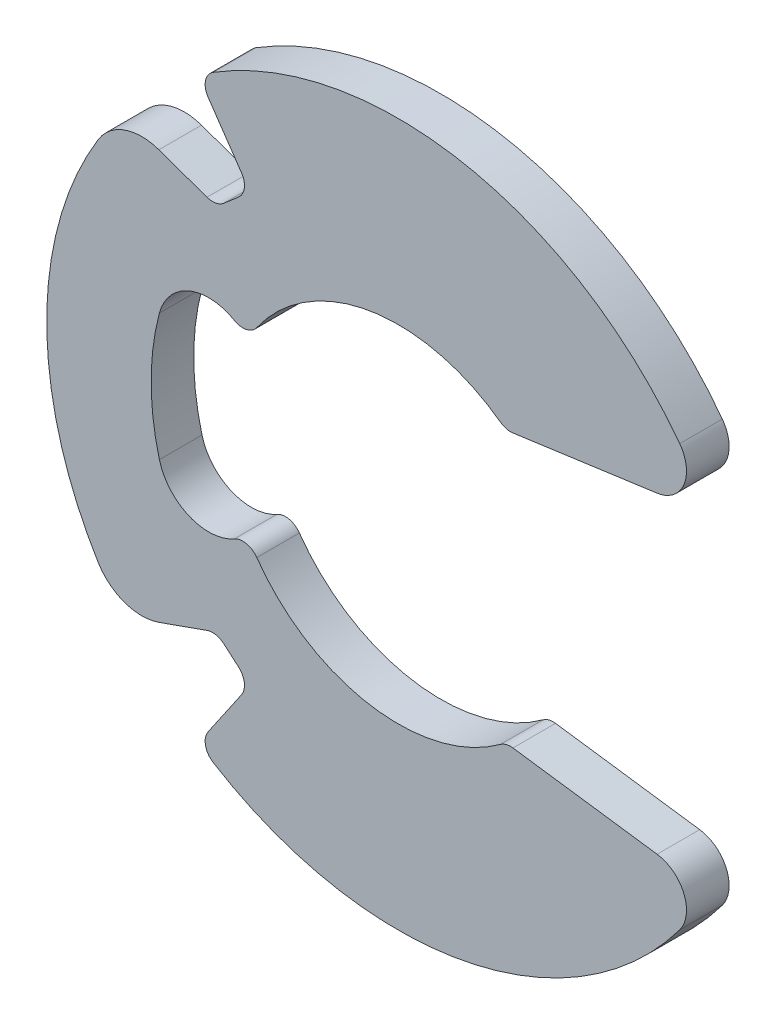
ISO-10303-21;
HEADER;
FILE_DESCRIPTION(('STEP AP214'),'2;1');
FILE_NAME('part.step','',(''),(''),'','','');
FILE_SCHEMA(('AUTOMOTIVE_DESIGN { 1 0 10303 214 1 1 1 1 }'));
ENDSEC;
DATA;
#1=APPLICATION_CONTEXT('core data for automotive mechanical design processes');
#2=APPLICATION_PROTOCOL_DEFINITION('international standard','automotive_design',2000,#1);
#3=PRODUCT_CONTEXT('',#1,'mechanical');
#4=PRODUCT('Part','Part','',(#3));
#5=PRODUCT_RELATED_PRODUCT_CATEGORY('part','',(#4));
#6=PRODUCT_DEFINITION_FORMATION('','',#4);
#7=PRODUCT_DEFINITION_CONTEXT('part definition',#1,'design');
#8=PRODUCT_DEFINITION('design','',#6,#7);
#9=PRODUCT_DEFINITION_SHAPE('','',#8);
#10=(LENGTH_UNIT() NAMED_UNIT(*) SI_UNIT(.MILLI.,.METRE.));
#11=(NAMED_UNIT(*) PLANE_ANGLE_UNIT() SI_UNIT($,.RADIAN.));
#12=(NAMED_UNIT(*) SI_UNIT($,.STERADIAN.) SOLID_ANGLE_UNIT());
#13=UNCERTAINTY_MEASURE_WITH_UNIT(LENGTH_MEASURE(1.E-05),#10,'distance_accuracy_value','');
#14=(GEOMETRIC_REPRESENTATION_CONTEXT(3) GLOBAL_UNCERTAINTY_ASSIGNED_CONTEXT((#13)) GLOBAL_UNIT_ASSIGNED_CONTEXT((#10,
#11,#12)) REPRESENTATION_CONTEXT('',''));
#15=CARTESIAN_POINT('',(0.,0.,0.));
#16=DIRECTION('',(0.,0.,1.));
#17=DIRECTION('',(1.,0.,0.));
#18=AXIS2_PLACEMENT_3D('',#15,#16,#17);
#19=CARTESIAN_POINT('',(0.,0.,1.27));
#20=DIRECTION('',(0.,0.,-1.));
#21=DIRECTION('',(-1.,0.,0.));
#22=AXIS2_PLACEMENT_3D('',#19,#20,#21);
#23=PLANE('',#22);
#24=CARTESIAN_POINT('',(0.,0.,1.27));
#25=DIRECTION('',(0.,0.,-1.));
#26=DIRECTION('',(1.,0.,0.));
#27=AXIS2_PLACEMENT_3D('',#24,#25,#26);
#28=CIRCLE('',#27,10.4775);
#29=CARTESIAN_POINT('',(8.39050144990017,-6.27514873682076,1.27));
#30=VERTEX_POINT('',#29);
#31=CARTESIAN_POINT('',(-5.51465485817055,-8.90879273780998,1.27));
#32=VERTEX_POINT('',#31);
#33=EDGE_CURVE('E432',#30,#32,#28,.T.);
#34=ORIENTED_EDGE('',*,*,#33,.F.);
#35=CARTESIAN_POINT('',(7.57687706687955,-5.66664946537147,1.27));
#36=DIRECTION('',(0.,0.,-1.));
#37=DIRECTION('',(-1.,0.,0.));
#38=AXIS2_PLACEMENT_3D('',#35,#36,#37);
#39=CIRCLE('',#38,1.016);
#40=CARTESIAN_POINT('',(7.71621548730132,-4.66024954258016,1.27));
#41=VERTEX_POINT('',#40);
#42=EDGE_CURVE('E10',#30,#41,#39,.F.);
#43=ORIENTED_EDGE('',*,*,#42,.T.);
#44=DIRECTION('',(0.990551105109562,-0.137144114588364,0.));
#45=VECTOR('',#44,1.);
#46=CARTESIAN_POINT('',(0.,-3.59192148204873,1.27));
#47=LINE('',#46,#45);
#48=CARTESIAN_POINT('',(3.41825205926127,-4.06518646523744,1.27));
#49=VERTEX_POINT('',#48);
#50=EDGE_CURVE('E396',#49,#41,#47,.T.);
#51=ORIENTED_EDGE('',*,*,#50,.F.);
#52=CARTESIAN_POINT('',(3.34858284905039,-4.5683864266331,1.27));
#53=DIRECTION('',(0.,0.,-1.));
#54=DIRECTION('',(-1.,0.,0.));
#55=AXIS2_PLACEMENT_3D('',#52,#53,#54);
#56=CIRCLE('',#55,0.508);
#57=CARTESIAN_POINT('',(3.04826151729699,-4.15866567088125,1.27));
#58=VERTEX_POINT('',#57);
#59=EDGE_CURVE('E359',#49,#58,#56,.F.);
#60=ORIENTED_EDGE('',*,*,#59,.T.);
#61=CARTESIAN_POINT('',(0.,0.,1.27));
#62=DIRECTION('',(0.,0.,-1.));
#63=DIRECTION('',(1.,0.,0.));
#64=AXIS2_PLACEMENT_3D('',#61,#62,#63);
#65=CIRCLE('',#64,5.1562);
#66=CARTESIAN_POINT('',(-4.21618561440545,-2.96819428354689,1.27));
#67=VERTEX_POINT('',#66);
#68=EDGE_CURVE('E436',#58,#67,#65,.T.);
#69=ORIENTED_EDGE('',*,*,#68,.T.);
#70=CARTESIAN_POINT('',(-4.63157335966707,-3.26062721788649,1.27));
#71=DIRECTION('',(0.,0.,-1.));
#72=DIRECTION('',(-1.,0.,0.));
#73=AXIS2_PLACEMENT_3D('',#70,#71,#72);
#74=CIRCLE('',#73,0.508);
#75=CARTESIAN_POINT('',(-4.88521418696267,-2.82047913970278,1.27));
#76=VERTEX_POINT('',#75);
#77=EDGE_CURVE('E368',#67,#76,#74,.F.);
#78=ORIENTED_EDGE('',*,*,#77,.T.);
#79=CARTESIAN_POINT('',(-5.64613666884946,-1.50003490515168,1.27));
#80=DIRECTION('',(0.,0.,-1.));
#81=DIRECTION('',(-1.,0.,0.));
#82=AXIS2_PLACEMENT_3D('',#79,#80,#81);
#83=CIRCLE('',#82,1.524);
#84=CARTESIAN_POINT('',(-7.11904188681019,-1.89134835866951,1.27));
#85=VERTEX_POINT('',#84);
#86=EDGE_CURVE('E261',#76,#85,#83,.T.);
#87=ORIENTED_EDGE('',*,*,#86,.T.);
#88=CARTESIAN_POINT('',(0.,0.,1.27));
#89=DIRECTION('',(0.,0.,-1.));
#90=DIRECTION('',(0.,1.,0.));
#91=AXIS2_PLACEMENT_3D('',#88,#89,#90);
#92=CIRCLE('',#91,7.366);
#93=CARTESIAN_POINT('',(-7.1190418868102,1.89134835866951,1.27));
#94=VERTEX_POINT('',#93);
#95=EDGE_CURVE('E468',#85,#94,#92,.T.);
#96=ORIENTED_EDGE('',*,*,#95,.T.);
#97=CARTESIAN_POINT('',(-5.64613666884946,1.50003490515168,1.27));
#98=DIRECTION('',(0.,0.,-1.));
#99=DIRECTION('',(-1.,0.,0.));
#100=AXIS2_PLACEMENT_3D('',#97,#98,#99);
#101=CIRCLE('',#100,1.524);
#102=CARTESIAN_POINT('',(-4.88521418696268,2.82047913970278,1.27));
#103=VERTEX_POINT('',#102);
#104=EDGE_CURVE('E269',#94,#103,#101,.T.);
#105=ORIENTED_EDGE('',*,*,#104,.T.);
#106=CARTESIAN_POINT('',(-4.63157335966708,3.26062721788649,1.27));
#107=DIRECTION('',(0.,0.,-1.));
#108=DIRECTION('',(-1.,0.,0.));
#109=AXIS2_PLACEMENT_3D('',#106,#107,#108);
#110=CIRCLE('',#109,0.508);
#111=CARTESIAN_POINT('',(-4.21618561440546,2.96819428354689,1.27));
#112=VERTEX_POINT('',#111);
#113=EDGE_CURVE('E373',#103,#112,#110,.F.);
#114=ORIENTED_EDGE('',*,*,#113,.T.);
#115=CARTESIAN_POINT('',(3.048261517297,4.15866567088126,1.27));
#116=VERTEX_POINT('',#115);
#117=EDGE_CURVE('E434',#112,#116,#65,.T.);
#118=ORIENTED_EDGE('',*,*,#117,.T.);
#119=CARTESIAN_POINT('',(3.3485828490504,4.5683864266331,1.27));
#120=DIRECTION('',(0.,0.,-1.));
#121=DIRECTION('',(-1.,0.,0.));
#122=AXIS2_PLACEMENT_3D('',#119,#120,#121);
#123=CIRCLE('',#122,0.508);
#124=CARTESIAN_POINT('',(3.41825205926129,4.06518646523744,1.27));
#125=VERTEX_POINT('',#124);
#126=EDGE_CURVE('E287',#116,#125,#123,.F.);
#127=ORIENTED_EDGE('',*,*,#126,.T.);
#128=DIRECTION('',(-0.990551105109562,-0.137144114588364,0.));
#129=VECTOR('',#128,1.);
#130=CARTESIAN_POINT('',(11.2983179723503,5.15619999999999,1.27));
#131=LINE('',#130,#129);
#132=CARTESIAN_POINT('',(7.71621548730134,4.66024954258016,1.27));
#133=VERTEX_POINT('',#132);
#134=EDGE_CURVE('E411',#133,#125,#131,.T.);
#135=ORIENTED_EDGE('',*,*,#134,.F.);
#136=CARTESIAN_POINT('',(7.57687706687956,5.66664946537147,1.27));
#137=DIRECTION('',(0.,0.,-1.));
#138=DIRECTION('',(-1.,0.,0.));
#139=AXIS2_PLACEMENT_3D('',#136,#137,#138);
#140=CIRCLE('',#139,1.016);
#141=CARTESIAN_POINT('',(8.39050144990018,6.27514873682076,1.27));
#142=VERTEX_POINT('',#141);
#143=EDGE_CURVE('E382',#133,#142,#140,.F.);
#144=ORIENTED_EDGE('',*,*,#143,.T.);
#145=CARTESIAN_POINT('',(-5.51465485817056,8.90879273780999,1.27));
#146=VERTEX_POINT('',#145);
#147=EDGE_CURVE('E431',#146,#142,#28,.T.);
#148=ORIENTED_EDGE('',*,*,#147,.F.);
#149=CARTESIAN_POINT('',(-5.24727765292592,8.47685127173435,1.27));
#150=DIRECTION('',(0.,0.,-1.));
#151=DIRECTION('',(-1.,0.,0.));
#152=AXIS2_PLACEMENT_3D('',#149,#150,#151);
#153=CIRCLE('',#152,0.508);
#154=CARTESIAN_POINT('',(-5.6664647231543,8.18989099547063,1.27));
#155=VERTEX_POINT('',#154);
#156=EDGE_CURVE('E345',#146,#155,#153,.F.);
#157=ORIENTED_EDGE('',*,*,#156,.T.);
#158=DIRECTION('',(0.564882433590001,-0.825171398087354,0.));
#159=VECTOR('',#158,1.);
#160=CARTESIAN_POINT('',(-7.96096866359448,11.541666359447,1.27));
#161=LINE('',#160,#159);
#162=CARTESIAN_POINT('',(-4.67174469224146,6.73681957776462,1.27));
#163=VERTEX_POINT('',#162);
#164=EDGE_CURVE('E465',#155,#163,#161,.T.);
#165=ORIENTED_EDGE('',*,*,#164,.T.);
#166=CARTESIAN_POINT('',(-5.09093176246983,6.4498593015009,1.27));
#167=DIRECTION('',(0.,0.,-1.));
#168=DIRECTION('',(-1.,0.,0.));
#169=AXIS2_PLACEMENT_3D('',#166,#167,#168);
#170=CIRCLE('',#169,0.508);
#171=CARTESIAN_POINT('',(-4.75923843445855,6.0650950410078,1.27));
#172=VERTEX_POINT('',#171);
#173=EDGE_CURVE('E317',#163,#172,#170,.T.);
#174=ORIENTED_EDGE('',*,*,#173,.T.);
#175=DIRECTION('',(-0.757409961600578,-0.652939622069462,0.));
#176=VECTOR('',#175,1.);
#177=CARTESIAN_POINT('',(-4.41503502304148,6.36182211981562,1.27));
#178=LINE('',#177,#176);
#179=CARTESIAN_POINT('',(-5.19974545035898,5.68534761350743,1.27));
#180=VERTEX_POINT('',#179);
#181=EDGE_CURVE('E460',#172,#180,#178,.T.);
#182=ORIENTED_EDGE('',*,*,#181,.T.);
#183=CARTESIAN_POINT('',(-5.53143877837027,6.07011187400052,1.27));
#184=DIRECTION('',(0.,0.,-1.));
#185=DIRECTION('',(-1.,0.,0.));
#186=AXIS2_PLACEMENT_3D('',#183,#184,#185);
#187=CIRCLE('',#186,0.508);
#188=CARTESIAN_POINT('',(-5.70123922502142,5.59133028672186,1.27));
#189=VERTEX_POINT('',#188);
#190=EDGE_CURVE('E308',#180,#189,#187,.T.);
#191=ORIENTED_EDGE('',*,*,#190,.T.);
#192=DIRECTION('',(-0.942483439524914,0.334252847738487,0.));
#193=VECTOR('',#192,1.);
#194=CARTESIAN_POINT('',(-5.42319262672811,5.49272073732714,1.27));
#195=LINE('',#194,#193);
#196=CARTESIAN_POINT('',(-7.13394241485243,6.09944013892937,1.27));
#197=VERTEX_POINT('',#196);
#198=EDGE_CURVE('E454',#189,#197,#195,.T.);
#199=ORIENTED_EDGE('',*,*,#198,.T.);
#200=CARTESIAN_POINT('',(-7.64334375480589,4.6630953770934,1.27));
#201=DIRECTION('',(0.,0.,-1.));
#202=DIRECTION('',(-1.,0.,0.));
#203=AXIS2_PLACEMENT_3D('',#200,#201,#202);
#204=CIRCLE('',#203,1.524);
#205=CARTESIAN_POINT('',(-8.94433843647498,5.45681373915185,1.27));
#206=VERTEX_POINT('',#205);
#207=EDGE_CURVE('E282',#197,#206,#204,.F.);
#208=ORIENTED_EDGE('',*,*,#207,.T.);
#209=CARTESIAN_POINT('',(-8.94433843647497,-5.45681373915185,1.27));
#210=VERTEX_POINT('',#209);
#211=EDGE_CURVE('E435',#210,#206,#28,.T.);
#212=ORIENTED_EDGE('',*,*,#211,.F.);
#213=CARTESIAN_POINT('',(-7.64334375480588,-4.6630953770934,1.27));
#214=DIRECTION('',(0.,0.,-1.));
#215=DIRECTION('',(-1.,0.,0.));
#216=AXIS2_PLACEMENT_3D('',#213,#214,#215);
#217=CIRCLE('',#216,1.524);
#218=CARTESIAN_POINT('',(-7.13394241485243,-6.09944013892937,1.27));
#219=VERTEX_POINT('',#218);
#220=EDGE_CURVE('E256',#210,#219,#217,.F.);
#221=ORIENTED_EDGE('',*,*,#220,.T.);
#222=DIRECTION('',(-0.942483439524914,-0.334252847738487,0.));
#223=VECTOR('',#222,1.);
#224=CARTESIAN_POINT('',(-5.42319262672811,-5.49272073732714,1.27));
#225=LINE('',#224,#223);
#226=CARTESIAN_POINT('',(-5.70123922502142,-5.59133028672186,1.27));
#227=VERTEX_POINT('',#226);
#228=EDGE_CURVE('E227',#227,#219,#225,.T.);
#229=ORIENTED_EDGE('',*,*,#228,.F.);
#230=CARTESIAN_POINT('',(-5.53143877837027,-6.07011187400052,1.27));
#231=DIRECTION('',(0.,0.,-1.));
#232=DIRECTION('',(-1.,0.,0.));
#233=AXIS2_PLACEMENT_3D('',#230,#231,#232);
#234=CIRCLE('',#233,0.508);
#235=CARTESIAN_POINT('',(-5.19974545035898,-5.68534761350743,1.27));
#236=VERTEX_POINT('',#235);
#237=EDGE_CURVE('E299',#227,#236,#234,.T.);
#238=ORIENTED_EDGE('',*,*,#237,.T.);
#239=DIRECTION('',(-0.757409961600578,0.652939622069462,0.));
#240=VECTOR('',#239,1.);
#241=CARTESIAN_POINT('',(-4.41503502304148,-6.36182211981562,1.27));
#242=LINE('',#241,#240);
#243=CARTESIAN_POINT('',(-4.75923843445855,-6.0650950410078,1.27));
#244=VERTEX_POINT('',#243);
#245=EDGE_CURVE('E421',#244,#236,#242,.T.);
#246=ORIENTED_EDGE('',*,*,#245,.F.);
#247=CARTESIAN_POINT('',(-5.09093176246983,-6.4498593015009,1.27));
#248=DIRECTION('',(0.,0.,-1.));
#249=DIRECTION('',(-1.,0.,0.));
#250=AXIS2_PLACEMENT_3D('',#247,#248,#249);
#251=CIRCLE('',#250,0.508);
#252=CARTESIAN_POINT('',(-4.67174469224146,-6.73681957776462,1.27));
#253=VERTEX_POINT('',#252);
#254=EDGE_CURVE('E326',#244,#253,#251,.T.);
#255=ORIENTED_EDGE('',*,*,#254,.T.);
#256=DIRECTION('',(0.564882433590001,0.825171398087354,0.));
#257=VECTOR('',#256,1.);
#258=CARTESIAN_POINT('',(-7.96096866359448,-11.541666359447,1.27));
#259=LINE('',#258,#257);
#260=CARTESIAN_POINT('',(-5.66646472315429,-8.18989099547062,1.27));
#261=VERTEX_POINT('',#260);
#262=EDGE_CURVE('E451',#261,#253,#259,.T.);
#263=ORIENTED_EDGE('',*,*,#262,.F.);
#264=CARTESIAN_POINT('',(-5.24727765292592,-8.47685127173434,1.27));
#265=DIRECTION('',(0.,0.,-1.));
#266=DIRECTION('',(-1.,0.,0.));
#267=AXIS2_PLACEMENT_3D('',#264,#265,#266);
#268=CIRCLE('',#267,0.508);
#269=EDGE_CURVE('E334',#261,#32,#268,.F.);
#270=ORIENTED_EDGE('',*,*,#269,.T.);
#271=EDGE_LOOP('',(#34,#43,#51,#60,#69,#78,#87,#96,#105,#114,#118,#127,#135,#144,#148,#157,#165,
#174,#182,#191,#199,#208,#212,#221,#229,#238,#246,#255,#263,#270));
#272=FACE_BOUND('',#271,.T.);
#273=ADVANCED_FACE('F15',(#272),#23,.F.);
#274=CARTESIAN_POINT('',(0.,0.,0.));
#275=DIRECTION('',(0.,0.,-1.));
#276=DIRECTION('',(-1.,0.,0.));
#277=AXIS2_PLACEMENT_3D('',#274,#275,#276);
#278=PLANE('',#277);
#279=DIRECTION('',(-0.990551105109562,0.137144114588364,0.));
#280=VECTOR('',#279,1.);
#281=CARTESIAN_POINT('',(-0.487956262792466,-3.52436279752117,0.));
#282=LINE('',#281,#280);
#283=CARTESIAN_POINT('',(7.71621548730133,-4.66024954258016,0.));
#284=VERTEX_POINT('',#283);
#285=CARTESIAN_POINT('',(3.41825205926127,-4.06518646523744,0.));
#286=VERTEX_POINT('',#285);
#287=EDGE_CURVE('E236',#284,#286,#282,.T.);
#288=ORIENTED_EDGE('',*,*,#287,.F.);
#289=CARTESIAN_POINT('',(7.57687706687955,-5.66664946537147,0.));
#290=DIRECTION('',(0.,0.,-1.));
#291=DIRECTION('',(-1.,0.,0.));
#292=AXIS2_PLACEMENT_3D('',#289,#290,#291);
#293=CIRCLE('',#292,1.016);
#294=CARTESIAN_POINT('',(8.39050144990017,-6.27514873682076,0.));
#295=VERTEX_POINT('',#294);
#296=EDGE_CURVE('E37',#284,#295,#293,.T.);
#297=ORIENTED_EDGE('',*,*,#296,.T.);
#298=CARTESIAN_POINT('',(0.,0.,0.));
#299=DIRECTION('',(0.,0.,-1.));
#300=DIRECTION('',(1.,0.,0.));
#301=AXIS2_PLACEMENT_3D('',#298,#299,#300);
#302=CIRCLE('',#301,10.4775);
#303=CARTESIAN_POINT('',(-5.51465485817055,-8.90879273780998,0.));
#304=VERTEX_POINT('',#303);
#305=EDGE_CURVE('E425',#295,#304,#302,.T.);
#306=ORIENTED_EDGE('',*,*,#305,.T.);
#307=CARTESIAN_POINT('',(-5.24727765292592,-8.47685127173434,0.));
#308=DIRECTION('',(0.,0.,-1.));
#309=DIRECTION('',(-1.,0.,0.));
#310=AXIS2_PLACEMENT_3D('',#307,#308,#309);
#311=CIRCLE('',#310,0.508);
#312=CARTESIAN_POINT('',(-5.6664647231543,-8.18989099547062,0.));
#313=VERTEX_POINT('',#312);
#314=EDGE_CURVE('E340',#304,#313,#311,.T.);
#315=ORIENTED_EDGE('',*,*,#314,.T.);
#316=DIRECTION('',(-0.56488243359,-0.825171398087354,0.));
#317=VECTOR('',#316,1.);
#318=CARTESIAN_POINT('',(-0.0408287063206822,0.0279498526490687,0.));
#319=LINE('',#318,#317);
#320=CARTESIAN_POINT('',(-4.67174469224146,-6.73681957776462,0.));
#321=VERTEX_POINT('',#320);
#322=EDGE_CURVE('E239',#321,#313,#319,.T.);
#323=ORIENTED_EDGE('',*,*,#322,.F.);
#324=CARTESIAN_POINT('',(-5.09093176246983,-6.4498593015009,0.));
#325=DIRECTION('',(0.,0.,-1.));
#326=DIRECTION('',(-1.,0.,0.));
#327=AXIS2_PLACEMENT_3D('',#324,#325,#326);
#328=CIRCLE('',#327,0.508);
#329=CARTESIAN_POINT('',(-4.75923843445854,-6.0650950410078,0.));
#330=VERTEX_POINT('',#329);
#331=EDGE_CURVE('E329',#321,#330,#328,.F.);
#332=ORIENTED_EDGE('',*,*,#331,.T.);
#333=DIRECTION('',(0.757409961600578,-0.652939622069462,0.));
#334=VECTOR('',#333,1.);
#335=CARTESIAN_POINT('',(-5.02845697562567,-5.8330100917258,0.));
#336=LINE('',#335,#334);
#337=CARTESIAN_POINT('',(-5.19974545035898,-5.68534761350743,0.));
#338=VERTEX_POINT('',#337);
#339=EDGE_CURVE('E235',#338,#330,#336,.T.);
#340=ORIENTED_EDGE('',*,*,#339,.F.);
#341=CARTESIAN_POINT('',(-5.53143877837027,-6.07011187400052,0.));
#342=DIRECTION('',(0.,0.,-1.));
#343=DIRECTION('',(-1.,0.,0.));
#344=AXIS2_PLACEMENT_3D('',#341,#342,#343);
#345=CIRCLE('',#344,0.508);
#346=CARTESIAN_POINT('',(-5.70123922502142,-5.59133028672186,0.));
#347=VERTEX_POINT('',#346);
#348=EDGE_CURVE('E234',#338,#347,#345,.F.);
#349=ORIENTED_EDGE('',*,*,#348,.T.);
#350=DIRECTION('',(0.942483439524914,0.334252847738487,0.));
#351=VECTOR('',#350,1.);
#352=CARTESIAN_POINT('',(1.12445357189555,-3.17059039944317,0.));
#353=LINE('',#352,#351);
#354=CARTESIAN_POINT('',(-7.13394241485243,-6.09944013892937,0.));
#355=VERTEX_POINT('',#354);
#356=EDGE_CURVE('E224',#355,#347,#353,.T.);
#357=ORIENTED_EDGE('',*,*,#356,.F.);
#358=CARTESIAN_POINT('',(-7.64334375480588,-4.6630953770934,0.));
#359=DIRECTION('',(0.,0.,-1.));
#360=DIRECTION('',(-1.,0.,0.));
#361=AXIS2_PLACEMENT_3D('',#358,#359,#360);
#362=CIRCLE('',#361,1.524);
#363=CARTESIAN_POINT('',(-8.94433843647497,-5.45681373915185,0.));
#364=VERTEX_POINT('',#363);
#365=EDGE_CURVE('E210',#355,#364,#362,.T.);
#366=ORIENTED_EDGE('',*,*,#365,.T.);
#367=CARTESIAN_POINT('',(-8.94433843647498,5.45681373915185,0.));
#368=VERTEX_POINT('',#367);
#369=EDGE_CURVE('E429',#364,#368,#302,.T.);
#370=ORIENTED_EDGE('',*,*,#369,.T.);
#371=CARTESIAN_POINT('',(-7.64334375480589,4.6630953770934,0.));
#372=DIRECTION('',(0.,0.,-1.));
#373=DIRECTION('',(-1.,0.,0.));
#374=AXIS2_PLACEMENT_3D('',#371,#372,#373);
#375=CIRCLE('',#374,1.524);
#376=CARTESIAN_POINT('',(-7.13394241485243,6.09944013892937,0.));
#377=VERTEX_POINT('',#376);
#378=EDGE_CURVE('E277',#368,#377,#375,.T.);
#379=ORIENTED_EDGE('',*,*,#378,.T.);
#380=DIRECTION('',(0.942483439524914,-0.334252847738487,0.));
#381=VECTOR('',#380,1.);
#382=CARTESIAN_POINT('',(1.12445357189554,3.17059039944317,0.));
#383=LINE('',#382,#381);
#384=CARTESIAN_POINT('',(-5.70123922502143,5.59133028672186,0.));
#385=VERTEX_POINT('',#384);
#386=EDGE_CURVE('E251',#377,#385,#383,.T.);
#387=ORIENTED_EDGE('',*,*,#386,.T.);
#388=CARTESIAN_POINT('',(-5.53143877837027,6.07011187400052,0.));
#389=DIRECTION('',(0.,0.,-1.));
#390=DIRECTION('',(-1.,0.,0.));
#391=AXIS2_PLACEMENT_3D('',#388,#389,#390);
#392=CIRCLE('',#391,0.508);
#393=CARTESIAN_POINT('',(-5.19974545035898,5.68534761350743,0.));
#394=VERTEX_POINT('',#393);
#395=EDGE_CURVE('E310',#385,#394,#392,.F.);
#396=ORIENTED_EDGE('',*,*,#395,.T.);
#397=DIRECTION('',(0.757409961600578,0.652939622069462,0.));
#398=VECTOR('',#397,1.);
#399=CARTESIAN_POINT('',(-5.02845697562567,5.8330100917258,0.));
#400=LINE('',#399,#398);
#401=CARTESIAN_POINT('',(-4.75923843445855,6.0650950410078,0.));
#402=VERTEX_POINT('',#401);
#403=EDGE_CURVE('E248',#394,#402,#400,.T.);
#404=ORIENTED_EDGE('',*,*,#403,.T.);
#405=CARTESIAN_POINT('',(-5.09093176246983,6.4498593015009,0.));
#406=DIRECTION('',(0.,0.,-1.));
#407=DIRECTION('',(-1.,0.,0.));
#408=AXIS2_PLACEMENT_3D('',#405,#406,#407);
#409=CIRCLE('',#408,0.508);
#410=CARTESIAN_POINT('',(-4.67174469224146,6.73681957776462,0.));
#411=VERTEX_POINT('',#410);
#412=EDGE_CURVE('E319',#402,#411,#409,.F.);
#413=ORIENTED_EDGE('',*,*,#412,.T.);
#414=DIRECTION('',(-0.564882433590001,0.825171398087354,0.));
#415=VECTOR('',#414,1.);
#416=CARTESIAN_POINT('',(-0.0408287063206891,-0.0279498526490583,0.));
#417=LINE('',#416,#415);
#418=CARTESIAN_POINT('',(-5.6664647231543,8.18989099547063,0.));
#419=VERTEX_POINT('',#418);
#420=EDGE_CURVE('E245',#411,#419,#417,.T.);
#421=ORIENTED_EDGE('',*,*,#420,.T.);
#422=CARTESIAN_POINT('',(-5.24727765292592,8.47685127173435,0.));
#423=DIRECTION('',(0.,0.,-1.));
#424=DIRECTION('',(-1.,0.,0.));
#425=AXIS2_PLACEMENT_3D('',#422,#423,#424);
#426=CIRCLE('',#425,0.508);
#427=CARTESIAN_POINT('',(-5.51465485817056,8.90879273780999,0.));
#428=VERTEX_POINT('',#427);
#429=EDGE_CURVE('E349',#419,#428,#426,.T.);
#430=ORIENTED_EDGE('',*,*,#429,.T.);
#431=CARTESIAN_POINT('',(8.39050144990018,6.27514873682076,0.));
#432=VERTEX_POINT('',#431);
#433=EDGE_CURVE('E418',#428,#432,#302,.T.);
#434=ORIENTED_EDGE('',*,*,#433,.T.);
#435=CARTESIAN_POINT('',(7.57687706687956,5.66664946537147,0.));
#436=DIRECTION('',(0.,0.,-1.));
#437=DIRECTION('',(-1.,0.,0.));
#438=AXIS2_PLACEMENT_3D('',#435,#436,#437);
#439=CIRCLE('',#438,1.016);
#440=CARTESIAN_POINT('',(7.71621548730134,4.66024954258016,0.));
#441=VERTEX_POINT('',#440);
#442=EDGE_CURVE('E386',#432,#441,#439,.T.);
#443=ORIENTED_EDGE('',*,*,#442,.T.);
#444=DIRECTION('',(0.990551105109562,0.137144114588364,0.));
#445=VECTOR('',#444,1.);
#446=CARTESIAN_POINT('',(-0.487956262792459,3.52436279752117,0.));
#447=LINE('',#446,#445);
#448=CARTESIAN_POINT('',(3.41825205926129,4.06518646523744,0.));
#449=VERTEX_POINT('',#448);
#450=EDGE_CURVE('E241',#449,#441,#447,.T.);
#451=ORIENTED_EDGE('',*,*,#450,.F.);
#452=CARTESIAN_POINT('',(3.3485828490504,4.5683864266331,0.));
#453=DIRECTION('',(0.,0.,-1.));
#454=DIRECTION('',(-1.,0.,0.));
#455=AXIS2_PLACEMENT_3D('',#452,#453,#454);
#456=CIRCLE('',#455,0.508);
#457=CARTESIAN_POINT('',(3.048261517297,4.15866567088126,0.));
#458=VERTEX_POINT('',#457);
#459=EDGE_CURVE('E292',#449,#458,#456,.T.);
#460=ORIENTED_EDGE('',*,*,#459,.T.);
#461=CARTESIAN_POINT('',(0.,0.,0.));
#462=DIRECTION('',(0.,0.,-1.));
#463=DIRECTION('',(1.,0.,0.));
#464=AXIS2_PLACEMENT_3D('',#461,#462,#463);
#465=CIRCLE('',#464,5.1562);
#466=CARTESIAN_POINT('',(-4.21618561440546,2.96819428354689,0.));
#467=VERTEX_POINT('',#466);
#468=EDGE_CURVE('E428',#467,#458,#465,.T.);
#469=ORIENTED_EDGE('',*,*,#468,.F.);
#470=CARTESIAN_POINT('',(-4.63157335966708,3.26062721788649,0.));
#471=DIRECTION('',(0.,0.,-1.));
#472=DIRECTION('',(-1.,0.,0.));
#473=AXIS2_PLACEMENT_3D('',#470,#471,#472);
#474=CIRCLE('',#473,0.508);
#475=CARTESIAN_POINT('',(-4.88521418696268,2.82047913970278,0.));
#476=VERTEX_POINT('',#475);
#477=EDGE_CURVE('E377',#467,#476,#474,.T.);
#478=ORIENTED_EDGE('',*,*,#477,.T.);
#479=CARTESIAN_POINT('',(-5.64613666884946,1.50003490515168,0.));
#480=DIRECTION('',(0.,0.,-1.));
#481=DIRECTION('',(-1.,0.,0.));
#482=AXIS2_PLACEMENT_3D('',#479,#480,#481);
#483=CIRCLE('',#482,1.524);
#484=CARTESIAN_POINT('',(-7.1190418868102,1.89134835866951,0.));
#485=VERTEX_POINT('',#484);
#486=EDGE_CURVE('E272',#476,#485,#483,.F.);
#487=ORIENTED_EDGE('',*,*,#486,.T.);
#488=CARTESIAN_POINT('',(0.,0.,0.));
#489=DIRECTION('',(0.,0.,-1.));
#490=DIRECTION('',(-1.,0.,0.));
#491=AXIS2_PLACEMENT_3D('',#488,#489,#490);
#492=CIRCLE('',#491,7.366);
#493=CARTESIAN_POINT('',(-7.11904188681019,-1.89134835866951,0.));
#494=VERTEX_POINT('',#493);
#495=EDGE_CURVE('E229',#485,#494,#492,.F.);
#496=ORIENTED_EDGE('',*,*,#495,.T.);
#497=CARTESIAN_POINT('',(-5.64613666884946,-1.50003490515168,0.));
#498=DIRECTION('',(0.,0.,-1.));
#499=DIRECTION('',(-1.,0.,0.));
#500=AXIS2_PLACEMENT_3D('',#497,#498,#499);
#501=CIRCLE('',#500,1.524);
#502=CARTESIAN_POINT('',(-4.88521418696267,-2.82047913970278,0.));
#503=VERTEX_POINT('',#502);
#504=EDGE_CURVE('E263',#494,#503,#501,.F.);
#505=ORIENTED_EDGE('',*,*,#504,.T.);
#506=CARTESIAN_POINT('',(-4.63157335966707,-3.26062721788649,0.));
#507=DIRECTION('',(0.,0.,-1.));
#508=DIRECTION('',(-1.,0.,0.));
#509=AXIS2_PLACEMENT_3D('',#506,#507,#508);
#510=CIRCLE('',#509,0.508);
#511=CARTESIAN_POINT('',(-4.21618561440545,-2.96819428354689,0.));
#512=VERTEX_POINT('',#511);
#513=EDGE_CURVE('E364',#503,#512,#510,.T.);
#514=ORIENTED_EDGE('',*,*,#513,.T.);
#515=CARTESIAN_POINT('',(3.04826151729699,-4.15866567088125,0.));
#516=VERTEX_POINT('',#515);
#517=EDGE_CURVE('E402',#516,#512,#465,.T.);
#518=ORIENTED_EDGE('',*,*,#517,.F.);
#519=CARTESIAN_POINT('',(3.34858284905039,-4.5683864266331,0.));
#520=DIRECTION('',(0.,0.,-1.));
#521=DIRECTION('',(-1.,0.,0.));
#522=AXIS2_PLACEMENT_3D('',#519,#520,#521);
#523=CIRCLE('',#522,0.508);
#524=EDGE_CURVE('E354',#516,#286,#523,.T.);
#525=ORIENTED_EDGE('',*,*,#524,.T.);
#526=EDGE_LOOP('',(#288,#297,#306,#315,#323,#332,#340,#349,#357,#366,#370,#379,#387,#396,#404,
#413,#421,#430,#434,#443,#451,#460,#469,#478,#487,#496,#505,#514,#518,#525));
#527=FACE_BOUND('',#526,.T.);
#528=ADVANCED_FACE('F231',(#527),#278,.T.);
#529=CARTESIAN_POINT('',(0.,0.,1.27));
#530=DIRECTION('',(0.,0.,-1.));
#531=DIRECTION('',(-1.,0.,0.));
#532=AXIS2_PLACEMENT_3D('',#529,#530,#531);
#533=CYLINDRICAL_SURFACE('',#532,5.1562);
#534=ORIENTED_EDGE('',*,*,#117,.F.);
#535=DIRECTION('',(0.,0.,-1.));
#536=VECTOR('',#535,1.);
#537=CARTESIAN_POINT('',(-4.21618561440546,2.96819428354689,1.27));
#538=LINE('',#537,#536);
#539=EDGE_CURVE('E375',#112,#467,#538,.T.);
#540=ORIENTED_EDGE('',*,*,#539,.T.);
#541=ORIENTED_EDGE('',*,*,#468,.T.);
#542=DIRECTION('',(0.,0.,-1.));
#543=VECTOR('',#542,1.);
#544=CARTESIAN_POINT('',(3.048261517297,4.15866567088126,1.27));
#545=LINE('',#544,#543);
#546=EDGE_CURVE('E284',#458,#116,#545,.F.);
#547=ORIENTED_EDGE('',*,*,#546,.T.);
#548=EDGE_LOOP('',(#534,#540,#541,#547));
#549=FACE_BOUND('',#548,.T.);
#550=ADVANCED_FACE('F495',(#549),#533,.F.);
#551=ORIENTED_EDGE('',*,*,#517,.T.);
#552=DIRECTION('',(0.,0.,-1.));
#553=VECTOR('',#552,1.);
#554=CARTESIAN_POINT('',(-4.21618561440545,-2.96819428354689,1.27));
#555=LINE('',#554,#553);
#556=EDGE_CURVE('E366',#512,#67,#555,.F.);
#557=ORIENTED_EDGE('',*,*,#556,.T.);
#558=ORIENTED_EDGE('',*,*,#68,.F.);
#559=DIRECTION('',(0.,0.,-1.));
#560=VECTOR('',#559,1.);
#561=CARTESIAN_POINT('',(3.04826151729699,-4.15866567088125,1.27));
#562=LINE('',#561,#560);
#563=EDGE_CURVE('E351',#58,#516,#562,.T.);
#564=ORIENTED_EDGE('',*,*,#563,.T.);
#565=EDGE_LOOP('',(#551,#557,#558,#564));
#566=FACE_BOUND('',#565,.T.);
#567=ADVANCED_FACE('F581',(#566),#533,.F.);
#568=CARTESIAN_POINT('',(0.,0.,1.27));
#569=DIRECTION('',(0.,0.,-1.));
#570=DIRECTION('',(-1.,0.,0.));
#571=AXIS2_PLACEMENT_3D('',#568,#569,#570);
#572=CYLINDRICAL_SURFACE('',#571,10.4775);
#573=ORIENTED_EDGE('',*,*,#147,.T.);
#574=DIRECTION('',(0.,0.,-1.));
#575=VECTOR('',#574,1.);
#576=CARTESIAN_POINT('',(8.39050144990018,6.27514873682076,1.27));
#577=LINE('',#576,#575);
#578=EDGE_CURVE('E384',#142,#432,#577,.T.);
#579=ORIENTED_EDGE('',*,*,#578,.T.);
#580=ORIENTED_EDGE('',*,*,#433,.F.);
#581=DIRECTION('',(0.,0.,-1.));
#582=VECTOR('',#581,1.);
#583=CARTESIAN_POINT('',(-5.51465485817056,8.90879273780999,1.27));
#584=LINE('',#583,#582);
#585=EDGE_CURVE('E342',#428,#146,#584,.F.);
#586=ORIENTED_EDGE('',*,*,#585,.T.);
#587=EDGE_LOOP('',(#573,#579,#580,#586));
#588=FACE_BOUND('',#587,.T.);
#589=ADVANCED_FACE('F17',(#588),#572,.T.);
#590=ORIENTED_EDGE('',*,*,#211,.T.);
#591=DIRECTION('',(0.,0.,-1.));
#592=VECTOR('',#591,1.);
#593=CARTESIAN_POINT('',(-8.94433843647498,5.45681373915186,1.27));
#594=LINE('',#593,#592);
#595=EDGE_CURVE('E274',#206,#368,#594,.T.);
#596=ORIENTED_EDGE('',*,*,#595,.T.);
#597=ORIENTED_EDGE('',*,*,#369,.F.);
#598=DIRECTION('',(0.,0.,-1.));
#599=VECTOR('',#598,1.);
#600=CARTESIAN_POINT('',(-8.94433843647497,-5.45681373915186,1.27));
#601=LINE('',#600,#599);
#602=EDGE_CURVE('E215',#364,#210,#601,.F.);
#603=ORIENTED_EDGE('',*,*,#602,.T.);
#604=EDGE_LOOP('',(#590,#596,#597,#603));
#605=FACE_BOUND('',#604,.T.);
#606=ADVANCED_FACE('F523',(#605),#572,.T.);
#607=ORIENTED_EDGE('',*,*,#305,.F.);
#608=DIRECTION('',(0.,0.,-1.));
#609=VECTOR('',#608,1.);
#610=CARTESIAN_POINT('',(8.39050144990017,-6.27514873682076,1.27));
#611=LINE('',#610,#609);
#612=EDGE_CURVE('E23',#295,#30,#611,.F.);
#613=ORIENTED_EDGE('',*,*,#612,.T.);
#614=ORIENTED_EDGE('',*,*,#33,.T.);
#615=DIRECTION('',(0.,0.,-1.));
#616=VECTOR('',#615,1.);
#617=CARTESIAN_POINT('',(-5.51465485817055,-8.90879273780998,1.27));
#618=LINE('',#617,#616);
#619=EDGE_CURVE('E337',#32,#304,#618,.T.);
#620=ORIENTED_EDGE('',*,*,#619,.T.);
#621=EDGE_LOOP('',(#607,#613,#614,#620));
#622=FACE_BOUND('',#621,.T.);
#623=ADVANCED_FACE('F589',(#622),#572,.T.);
#624=CARTESIAN_POINT('',(0.,-3.59192148204873,-28.9774986298856));
#625=DIRECTION('',(-0.137144114588364,-0.990551105109562,0.));
#626=DIRECTION('',(0.990551105109562,-0.137144114588364,0.));
#627=AXIS2_PLACEMENT_3D('',#624,#625,#626);
#628=PLANE('',#627);
#629=ORIENTED_EDGE('',*,*,#50,.T.);
#630=DIRECTION('',(0.,0.,1.));
#631=VECTOR('',#630,1.);
#632=CARTESIAN_POINT('',(7.71621548730132,-4.66024954258016,0.));
#633=LINE('',#632,#631);
#634=EDGE_CURVE('E388',#41,#284,#633,.F.);
#635=ORIENTED_EDGE('',*,*,#634,.T.);
#636=ORIENTED_EDGE('',*,*,#287,.T.);
#637=DIRECTION('',(0.,0.,-1.));
#638=VECTOR('',#637,1.);
#639=CARTESIAN_POINT('',(3.41825205926127,-4.06518646523744,-28.9774986298856));
#640=LINE('',#639,#638);
#641=EDGE_CURVE('E357',#286,#49,#640,.F.);
#642=ORIENTED_EDGE('',*,*,#641,.T.);
#643=EDGE_LOOP('',(#629,#635,#636,#642));
#644=FACE_BOUND('',#643,.T.);
#645=ADVANCED_FACE('F394',(#644),#628,.F.);
#646=CARTESIAN_POINT('',(11.2983179723503,5.15619999999999,-28.9774986298856));
#647=DIRECTION('',(-0.137144114588364,0.990551105109562,0.));
#648=DIRECTION('',(-0.990551105109562,-0.137144114588364,0.));
#649=AXIS2_PLACEMENT_3D('',#646,#647,#648);
#650=PLANE('',#649);
#651=ORIENTED_EDGE('',*,*,#450,.T.);
#652=DIRECTION('',(0.,0.,1.));
#653=VECTOR('',#652,1.);
#654=CARTESIAN_POINT('',(7.71621548730134,4.66024954258016,1.27));
#655=LINE('',#654,#653);
#656=EDGE_CURVE('E379',#441,#133,#655,.T.);
#657=ORIENTED_EDGE('',*,*,#656,.T.);
#658=ORIENTED_EDGE('',*,*,#134,.T.);
#659=DIRECTION('',(0.,0.,-1.));
#660=VECTOR('',#659,1.);
#661=CARTESIAN_POINT('',(3.41825205926129,4.06518646523744,-28.9774986298856));
#662=LINE('',#661,#660);
#663=EDGE_CURVE('E290',#125,#449,#662,.T.);
#664=ORIENTED_EDGE('',*,*,#663,.T.);
#665=EDGE_LOOP('',(#651,#657,#658,#664));
#666=FACE_BOUND('',#665,.T.);
#667=ADVANCED_FACE('F506',(#666),#650,.F.);
#668=CARTESIAN_POINT('',(-7.96096866359448,-11.541666359447,-28.9619533727259));
#669=DIRECTION('',(0.825171398087354,-0.56488243359,0.));
#670=DIRECTION('',(0.56488243359,0.825171398087354,0.));
#671=AXIS2_PLACEMENT_3D('',#668,#669,#670);
#672=PLANE('',#671);
#673=ORIENTED_EDGE('',*,*,#322,.T.);
#674=DIRECTION('',(0.,0.,1.));
#675=VECTOR('',#674,1.);
#676=CARTESIAN_POINT('',(-5.66646472315429,-8.18989099547062,1.27));
#677=LINE('',#676,#675);
#678=EDGE_CURVE('E331',#313,#261,#677,.T.);
#679=ORIENTED_EDGE('',*,*,#678,.T.);
#680=ORIENTED_EDGE('',*,*,#262,.T.);
#681=DIRECTION('',(0.,0.,1.));
#682=VECTOR('',#681,1.);
#683=CARTESIAN_POINT('',(-4.67174469224146,-6.73681957776462,0.));
#684=LINE('',#683,#682);
#685=EDGE_CURVE('E324',#253,#321,#684,.F.);
#686=ORIENTED_EDGE('',*,*,#685,.T.);
#687=EDGE_LOOP('',(#673,#679,#680,#686));
#688=FACE_BOUND('',#687,.T.);
#689=ADVANCED_FACE('F443',(#688),#672,.F.);
#690=CARTESIAN_POINT('',(-4.41503502304148,-6.36182211981562,-28.9619533727259));
#691=DIRECTION('',(0.652939622069462,0.757409961600577,0.));
#692=DIRECTION('',(-0.757409961600578,0.652939622069462,0.));
#693=AXIS2_PLACEMENT_3D('',#690,#691,#692);
#694=PLANE('',#693);
#695=ORIENTED_EDGE('',*,*,#339,.T.);
#696=DIRECTION('',(0.,0.,1.));
#697=VECTOR('',#696,1.);
#698=CARTESIAN_POINT('',(-4.75923843445855,-6.0650950410078,1.27));
#699=LINE('',#698,#697);
#700=EDGE_CURVE('E321',#330,#244,#699,.T.);
#701=ORIENTED_EDGE('',*,*,#700,.T.);
#702=ORIENTED_EDGE('',*,*,#245,.T.);
#703=DIRECTION('',(0.,0.,1.));
#704=VECTOR('',#703,1.);
#705=CARTESIAN_POINT('',(-5.19974545035898,-5.68534761350743,0.));
#706=LINE('',#705,#704);
#707=EDGE_CURVE('E297',#236,#338,#706,.F.);
#708=ORIENTED_EDGE('',*,*,#707,.T.);
#709=EDGE_LOOP('',(#695,#701,#702,#708));
#710=FACE_BOUND('',#709,.T.);
#711=ADVANCED_FACE('F560',(#710),#694,.F.);
#712=CARTESIAN_POINT('',(-5.42319262672811,-5.49272073732714,-28.9619533727259));
#713=DIRECTION('',(-0.334252847738487,0.942483439524914,0.));
#714=DIRECTION('',(-0.942483439524914,-0.334252847738487,0.));
#715=AXIS2_PLACEMENT_3D('',#712,#713,#714);
#716=PLANE('',#715);
#717=ORIENTED_EDGE('',*,*,#356,.T.);
#718=DIRECTION('',(0.,0.,1.));
#719=VECTOR('',#718,1.);
#720=CARTESIAN_POINT('',(-5.70123922502142,-5.59133028672186,1.26999999999999));
#721=LINE('',#720,#719);
#722=EDGE_CURVE('E295',#347,#227,#721,.T.);
#723=ORIENTED_EDGE('',*,*,#722,.T.);
#724=ORIENTED_EDGE('',*,*,#228,.T.);
#725=DIRECTION('',(0.,0.,1.));
#726=VECTOR('',#725,1.);
#727=CARTESIAN_POINT('',(-7.13394241485243,-6.09944013892937,0.));
#728=LINE('',#727,#726);
#729=EDGE_CURVE('E214',#219,#355,#728,.F.);
#730=ORIENTED_EDGE('',*,*,#729,.T.);
#731=EDGE_LOOP('',(#717,#723,#724,#730));
#732=FACE_BOUND('',#731,.T.);
#733=ADVANCED_FACE('F222',(#732),#716,.F.);
#734=CARTESIAN_POINT('',(-7.96096866359448,11.541666359447,-28.9619533727259));
#735=DIRECTION('',(-0.825171398087354,-0.564882433590001,0.));
#736=DIRECTION('',(0.564882433590001,-0.825171398087354,0.));
#737=AXIS2_PLACEMENT_3D('',#734,#735,#736);
#738=PLANE('',#737);
#739=ORIENTED_EDGE('',*,*,#164,.F.);
#740=DIRECTION('',(0.,0.,-1.));
#741=VECTOR('',#740,1.);
#742=CARTESIAN_POINT('',(-5.6664647231543,8.18989099547063,-28.9619533727259));
#743=LINE('',#742,#741);
#744=EDGE_CURVE('E347',#155,#419,#743,.T.);
#745=ORIENTED_EDGE('',*,*,#744,.T.);
#746=ORIENTED_EDGE('',*,*,#420,.F.);
#747=DIRECTION('',(0.,0.,1.));
#748=VECTOR('',#747,1.);
#749=CARTESIAN_POINT('',(-4.67174469224146,6.73681957776462,1.26999999999999));
#750=LINE('',#749,#748);
#751=EDGE_CURVE('E312',#411,#163,#750,.T.);
#752=ORIENTED_EDGE('',*,*,#751,.T.);
#753=EDGE_LOOP('',(#739,#745,#746,#752));
#754=FACE_BOUND('',#753,.T.);
#755=ADVANCED_FACE('F552',(#754),#738,.T.);
#756=CARTESIAN_POINT('',(-4.41503502304148,6.36182211981562,-28.9619533727259));
#757=DIRECTION('',(-0.652939622069462,0.757409961600578,0.));
#758=DIRECTION('',(-0.757409961600578,-0.652939622069462,0.));
#759=AXIS2_PLACEMENT_3D('',#756,#757,#758);
#760=PLANE('',#759);
#761=ORIENTED_EDGE('',*,*,#181,.F.);
#762=DIRECTION('',(0.,0.,1.));
#763=VECTOR('',#762,1.);
#764=CARTESIAN_POINT('',(-4.75923843445855,6.0650950410078,0.));
#765=LINE('',#764,#763);
#766=EDGE_CURVE('E315',#172,#402,#765,.F.);
#767=ORIENTED_EDGE('',*,*,#766,.T.);
#768=ORIENTED_EDGE('',*,*,#403,.F.);
#769=DIRECTION('',(0.,0.,1.));
#770=VECTOR('',#769,1.);
#771=CARTESIAN_POINT('',(-5.19974545035898,5.68534761350743,1.27));
#772=LINE('',#771,#770);
#773=EDGE_CURVE('E303',#394,#180,#772,.T.);
#774=ORIENTED_EDGE('',*,*,#773,.T.);
#775=EDGE_LOOP('',(#761,#767,#768,#774));
#776=FACE_BOUND('',#775,.T.);
#777=ADVANCED_FACE('F542',(#776),#760,.T.);
#778=CARTESIAN_POINT('',(-5.42319262672811,5.49272073732714,-28.9619533727259));
#779=DIRECTION('',(0.334252847738487,0.942483439524914,0.));
#780=DIRECTION('',(-0.942483439524914,0.334252847738487,0.));
#781=AXIS2_PLACEMENT_3D('',#778,#779,#780);
#782=PLANE('',#781);
#783=ORIENTED_EDGE('',*,*,#198,.F.);
#784=DIRECTION('',(0.,0.,1.));
#785=VECTOR('',#784,1.);
#786=CARTESIAN_POINT('',(-5.70123922502142,5.59133028672186,0.));
#787=LINE('',#786,#785);
#788=EDGE_CURVE('E306',#189,#385,#787,.F.);
#789=ORIENTED_EDGE('',*,*,#788,.T.);
#790=ORIENTED_EDGE('',*,*,#386,.F.);
#791=DIRECTION('',(0.,0.,-1.));
#792=VECTOR('',#791,1.);
#793=CARTESIAN_POINT('',(-7.13394241485243,6.09944013892937,-28.9619533727259));
#794=LINE('',#793,#792);
#795=EDGE_CURVE('E279',#377,#197,#794,.F.);
#796=ORIENTED_EDGE('',*,*,#795,.T.);
#797=EDGE_LOOP('',(#783,#789,#790,#796));
#798=FACE_BOUND('',#797,.T.);
#799=ADVANCED_FACE('F532',(#798),#782,.T.);
#800=CARTESIAN_POINT('',(0.,0.,-27.5542820641455));
#801=DIRECTION('',(0.,0.,1.));
#802=DIRECTION('',(1.,0.,0.));
#803=AXIS2_PLACEMENT_3D('',#800,#801,#802);
#804=CYLINDRICAL_SURFACE('',#803,7.366);
#805=ORIENTED_EDGE('',*,*,#495,.F.);
#806=DIRECTION('',(0.,0.,1.));
#807=VECTOR('',#806,1.);
#808=CARTESIAN_POINT('',(-7.1190418868102,1.89134835866951,-27.5542820641455));
#809=LINE('',#808,#807);
#810=EDGE_CURVE('E266',#485,#94,#809,.T.);
#811=ORIENTED_EDGE('',*,*,#810,.T.);
#812=ORIENTED_EDGE('',*,*,#95,.F.);
#813=DIRECTION('',(0.,0.,1.));
#814=VECTOR('',#813,1.);
#815=CARTESIAN_POINT('',(-7.11904188681019,-1.89134835866951,-27.5542820641455));
#816=LINE('',#815,#814);
#817=EDGE_CURVE('E258',#85,#494,#816,.F.);
#818=ORIENTED_EDGE('',*,*,#817,.T.);
#819=EDGE_LOOP('',(#805,#811,#812,#818));
#820=FACE_BOUND('',#819,.T.);
#821=ADVANCED_FACE('F478',(#820),#804,.F.);
#822=CARTESIAN_POINT('',(-7.64334375480588,-4.6630953770934,1.27));
#823=DIRECTION('',(0.,0.,-1.));
#824=DIRECTION('',(-1.,0.,0.));
#825=AXIS2_PLACEMENT_3D('',#822,#823,#824);
#826=CYLINDRICAL_SURFACE('',#825,1.524);
#827=ORIENTED_EDGE('',*,*,#220,.F.);
#828=ORIENTED_EDGE('',*,*,#602,.F.);
#829=ORIENTED_EDGE('',*,*,#365,.F.);
#830=ORIENTED_EDGE('',*,*,#729,.F.);
#831=EDGE_LOOP('',(#827,#828,#829,#830));
#832=FACE_BOUND('',#831,.T.);
#833=ADVANCED_FACE('F213',(#832),#826,.T.);
#834=CARTESIAN_POINT('',(-5.64613666884946,-1.50003490515168,-27.5542820641455));
#835=DIRECTION('',(0.,0.,1.));
#836=DIRECTION('',(1.,0.,0.));
#837=AXIS2_PLACEMENT_3D('',#834,#835,#836);
#838=CYLINDRICAL_SURFACE('',#837,1.524);
#839=ORIENTED_EDGE('',*,*,#86,.F.);
#840=DIRECTION('',(0.,0.,1.));
#841=VECTOR('',#840,1.);
#842=CARTESIAN_POINT('',(-4.88521418696267,-2.82047913970278,-27.5542820641455));
#843=LINE('',#842,#841);
#844=EDGE_CURVE('E361',#76,#503,#843,.F.);
#845=ORIENTED_EDGE('',*,*,#844,.T.);
#846=ORIENTED_EDGE('',*,*,#504,.F.);
#847=ORIENTED_EDGE('',*,*,#817,.F.);
#848=EDGE_LOOP('',(#839,#845,#846,#847));
#849=FACE_BOUND('',#848,.T.);
#850=ADVANCED_FACE('F482',(#849),#838,.F.);
#851=CARTESIAN_POINT('',(-5.64613666884946,1.50003490515168,-27.5542820641455));
#852=DIRECTION('',(0.,0.,1.));
#853=DIRECTION('',(1.,0.,0.));
#854=AXIS2_PLACEMENT_3D('',#851,#852,#853);
#855=CYLINDRICAL_SURFACE('',#854,1.524);
#856=ORIENTED_EDGE('',*,*,#486,.F.);
#857=DIRECTION('',(0.,0.,1.));
#858=VECTOR('',#857,1.);
#859=CARTESIAN_POINT('',(-4.88521418696268,2.82047913970279,-27.5542820641455));
#860=LINE('',#859,#858);
#861=EDGE_CURVE('E370',#476,#103,#860,.T.);
#862=ORIENTED_EDGE('',*,*,#861,.T.);
#863=ORIENTED_EDGE('',*,*,#104,.F.);
#864=ORIENTED_EDGE('',*,*,#810,.F.);
#865=EDGE_LOOP('',(#856,#862,#863,#864));
#866=FACE_BOUND('',#865,.T.);
#867=ADVANCED_FACE('F486',(#866),#855,.F.);
#868=CARTESIAN_POINT('',(-7.64334375480589,4.6630953770934,1.27));
#869=DIRECTION('',(0.,0.,-1.));
#870=DIRECTION('',(-1.,0.,0.));
#871=AXIS2_PLACEMENT_3D('',#868,#869,#870);
#872=CYLINDRICAL_SURFACE('',#871,1.524);
#873=ORIENTED_EDGE('',*,*,#207,.F.);
#874=ORIENTED_EDGE('',*,*,#795,.F.);
#875=ORIENTED_EDGE('',*,*,#378,.F.);
#876=ORIENTED_EDGE('',*,*,#595,.F.);
#877=EDGE_LOOP('',(#873,#874,#875,#876));
#878=FACE_BOUND('',#877,.T.);
#879=ADVANCED_FACE('F528',(#878),#872,.T.);
#880=CARTESIAN_POINT('',(3.3485828490504,4.5683864266331,1.27));
#881=DIRECTION('',(0.,0.,-1.));
#882=DIRECTION('',(-1.,0.,0.));
#883=AXIS2_PLACEMENT_3D('',#880,#881,#882);
#884=CYLINDRICAL_SURFACE('',#883,0.508);
#885=ORIENTED_EDGE('',*,*,#459,.F.);
#886=ORIENTED_EDGE('',*,*,#663,.F.);
#887=ORIENTED_EDGE('',*,*,#126,.F.);
#888=ORIENTED_EDGE('',*,*,#546,.F.);
#889=EDGE_LOOP('',(#885,#886,#887,#888));
#890=FACE_BOUND('',#889,.T.);
#891=ADVANCED_FACE('F500',(#890),#884,.T.);
#892=CARTESIAN_POINT('',(-5.53143877837027,-6.07011187400052,-28.9619533727259));
#893=DIRECTION('',(0.,0.,-1.));
#894=DIRECTION('',(-1.,0.,0.));
#895=AXIS2_PLACEMENT_3D('',#892,#893,#894);
#896=CYLINDRICAL_SURFACE('',#895,0.508);
#897=ORIENTED_EDGE('',*,*,#348,.F.);
#898=ORIENTED_EDGE('',*,*,#707,.F.);
#899=ORIENTED_EDGE('',*,*,#237,.F.);
#900=ORIENTED_EDGE('',*,*,#722,.F.);
#901=EDGE_LOOP('',(#897,#898,#899,#900));
#902=FACE_BOUND('',#901,.T.);
#903=ADVANCED_FACE('F558',(#902),#896,.F.);
#904=CARTESIAN_POINT('',(-5.53143877837027,6.07011187400052,-28.9619533727259));
#905=DIRECTION('',(0.,0.,-1.));
#906=DIRECTION('',(-1.,0.,0.));
#907=AXIS2_PLACEMENT_3D('',#904,#905,#906);
#908=CYLINDRICAL_SURFACE('',#907,0.508);
#909=ORIENTED_EDGE('',*,*,#395,.F.);
#910=ORIENTED_EDGE('',*,*,#788,.F.);
#911=ORIENTED_EDGE('',*,*,#190,.F.);
#912=ORIENTED_EDGE('',*,*,#773,.F.);
#913=EDGE_LOOP('',(#909,#910,#911,#912));
#914=FACE_BOUND('',#913,.T.);
#915=ADVANCED_FACE('F538',(#914),#908,.F.);
#916=CARTESIAN_POINT('',(-5.09093176246983,6.4498593015009,-28.9619533727259));
#917=DIRECTION('',(0.,0.,-1.));
#918=DIRECTION('',(-1.,0.,0.));
#919=AXIS2_PLACEMENT_3D('',#916,#917,#918);
#920=CYLINDRICAL_SURFACE('',#919,0.508);
#921=ORIENTED_EDGE('',*,*,#412,.F.);
#922=ORIENTED_EDGE('',*,*,#766,.F.);
#923=ORIENTED_EDGE('',*,*,#173,.F.);
#924=ORIENTED_EDGE('',*,*,#751,.F.);
#925=EDGE_LOOP('',(#921,#922,#923,#924));
#926=FACE_BOUND('',#925,.T.);
#927=ADVANCED_FACE('F548',(#926),#920,.F.);
#928=CARTESIAN_POINT('',(-5.09093176246983,-6.4498593015009,-28.9619533727259));
#929=DIRECTION('',(0.,0.,-1.));
#930=DIRECTION('',(-1.,0.,0.));
#931=AXIS2_PLACEMENT_3D('',#928,#929,#930);
#932=CYLINDRICAL_SURFACE('',#931,0.508);
#933=ORIENTED_EDGE('',*,*,#331,.F.);
#934=ORIENTED_EDGE('',*,*,#685,.F.);
#935=ORIENTED_EDGE('',*,*,#254,.F.);
#936=ORIENTED_EDGE('',*,*,#700,.F.);
#937=EDGE_LOOP('',(#933,#934,#935,#936));
#938=FACE_BOUND('',#937,.T.);
#939=ADVANCED_FACE('F563',(#938),#932,.F.);
#940=CARTESIAN_POINT('',(-5.24727765292592,-8.47685127173434,1.27));
#941=DIRECTION('',(0.,0.,-1.));
#942=DIRECTION('',(-1.,0.,0.));
#943=AXIS2_PLACEMENT_3D('',#940,#941,#942);
#944=CYLINDRICAL_SURFACE('',#943,0.508);
#945=ORIENTED_EDGE('',*,*,#314,.F.);
#946=ORIENTED_EDGE('',*,*,#619,.F.);
#947=ORIENTED_EDGE('',*,*,#269,.F.);
#948=ORIENTED_EDGE('',*,*,#678,.F.);
#949=EDGE_LOOP('',(#945,#946,#947,#948));
#950=FACE_BOUND('',#949,.T.);
#951=ADVANCED_FACE('F449',(#950),#944,.T.);
#952=CARTESIAN_POINT('',(-5.24727765292592,8.47685127173435,1.27));
#953=DIRECTION('',(0.,0.,-1.));
#954=DIRECTION('',(-1.,0.,0.));
#955=AXIS2_PLACEMENT_3D('',#952,#953,#954);
#956=CYLINDRICAL_SURFACE('',#955,0.508);
#957=ORIENTED_EDGE('',*,*,#429,.F.);
#958=ORIENTED_EDGE('',*,*,#744,.F.);
#959=ORIENTED_EDGE('',*,*,#156,.F.);
#960=ORIENTED_EDGE('',*,*,#585,.F.);
#961=EDGE_LOOP('',(#957,#958,#959,#960));
#962=FACE_BOUND('',#961,.T.);
#963=ADVANCED_FACE('F555',(#962),#956,.T.);
#964=CARTESIAN_POINT('',(3.34858284905039,-4.5683864266331,1.27));
#965=DIRECTION('',(0.,0.,-1.));
#966=DIRECTION('',(-1.,0.,0.));
#967=AXIS2_PLACEMENT_3D('',#964,#965,#966);
#968=CYLINDRICAL_SURFACE('',#967,0.508);
#969=ORIENTED_EDGE('',*,*,#59,.F.);
#970=ORIENTED_EDGE('',*,*,#641,.F.);
#971=ORIENTED_EDGE('',*,*,#524,.F.);
#972=ORIENTED_EDGE('',*,*,#563,.F.);
#973=EDGE_LOOP('',(#969,#970,#971,#972));
#974=FACE_BOUND('',#973,.T.);
#975=ADVANCED_FACE('F406',(#974),#968,.T.);
#976=CARTESIAN_POINT('',(-4.63157335966707,-3.26062721788649,1.27));
#977=DIRECTION('',(0.,0.,-1.));
#978=DIRECTION('',(-1.,0.,0.));
#979=AXIS2_PLACEMENT_3D('',#976,#977,#978);
#980=CYLINDRICAL_SURFACE('',#979,0.508);
#981=ORIENTED_EDGE('',*,*,#77,.F.);
#982=ORIENTED_EDGE('',*,*,#556,.F.);
#983=ORIENTED_EDGE('',*,*,#513,.F.);
#984=ORIENTED_EDGE('',*,*,#844,.F.);
#985=EDGE_LOOP('',(#981,#982,#983,#984));
#986=FACE_BOUND('',#985,.T.);
#987=ADVANCED_FACE('F593',(#986),#980,.T.);
#988=CARTESIAN_POINT('',(-4.63157335966708,3.26062721788649,1.27));
#989=DIRECTION('',(0.,0.,1.));
#990=DIRECTION('',(1.,0.,0.));
#991=AXIS2_PLACEMENT_3D('',#988,#989,#990);
#992=CYLINDRICAL_SURFACE('',#991,0.508);
#993=ORIENTED_EDGE('',*,*,#477,.F.);
#994=ORIENTED_EDGE('',*,*,#539,.F.);
#995=ORIENTED_EDGE('',*,*,#113,.F.);
#996=ORIENTED_EDGE('',*,*,#861,.F.);
#997=EDGE_LOOP('',(#993,#994,#995,#996));
#998=FACE_BOUND('',#997,.T.);
#999=ADVANCED_FACE('F490',(#998),#992,.T.);
#1000=CARTESIAN_POINT('',(7.57687706687956,5.66664946537147,1.27));
#1001=DIRECTION('',(0.,0.,-1.));
#1002=DIRECTION('',(-1.,0.,0.));
#1003=AXIS2_PLACEMENT_3D('',#1000,#1001,#1002);
#1004=CYLINDRICAL_SURFACE('',#1003,1.016);
#1005=ORIENTED_EDGE('',*,*,#442,.F.);
#1006=ORIENTED_EDGE('',*,*,#578,.F.);
#1007=ORIENTED_EDGE('',*,*,#143,.F.);
#1008=ORIENTED_EDGE('',*,*,#656,.F.);
#1009=EDGE_LOOP('',(#1005,#1006,#1007,#1008));
#1010=FACE_BOUND('',#1009,.T.);
#1011=ADVANCED_FACE('F511',(#1010),#1004,.T.);
#1012=CARTESIAN_POINT('',(7.57687706687955,-5.66664946537147,1.27));
#1013=DIRECTION('',(0.,0.,-1.));
#1014=DIRECTION('',(-1.,0.,0.));
#1015=AXIS2_PLACEMENT_3D('',#1012,#1013,#1014);
#1016=CYLINDRICAL_SURFACE('',#1015,1.016);
#1017=ORIENTED_EDGE('',*,*,#42,.F.);
#1018=ORIENTED_EDGE('',*,*,#612,.F.);
#1019=ORIENTED_EDGE('',*,*,#296,.F.);
#1020=ORIENTED_EDGE('',*,*,#634,.F.);
#1021=EDGE_LOOP('',(#1017,#1018,#1019,#1020));
#1022=FACE_BOUND('',#1021,.T.);
#1023=ADVANCED_FACE('F640',(#1022),#1016,.T.);
#1024=CLOSED_SHELL('',(#273,#528,#550,#567,#589,#606,#623,#645,#667,#689,#711,#733,#755,#777,
#799,#821,#833,#850,#867,#879,#891,#903,#915,#927,#939,#951,#963,#975,#987,#999,#1011,#1023));
#1025=MANIFOLD_SOLID_BREP('B1',#1024);
#1026=ADVANCED_BREP_SHAPE_REPRESENTATION('',(#18,#1025),#14);
#1027=SHAPE_DEFINITION_REPRESENTATION(#9,#1026);
ENDSEC;
END-ISO-10303-21;
